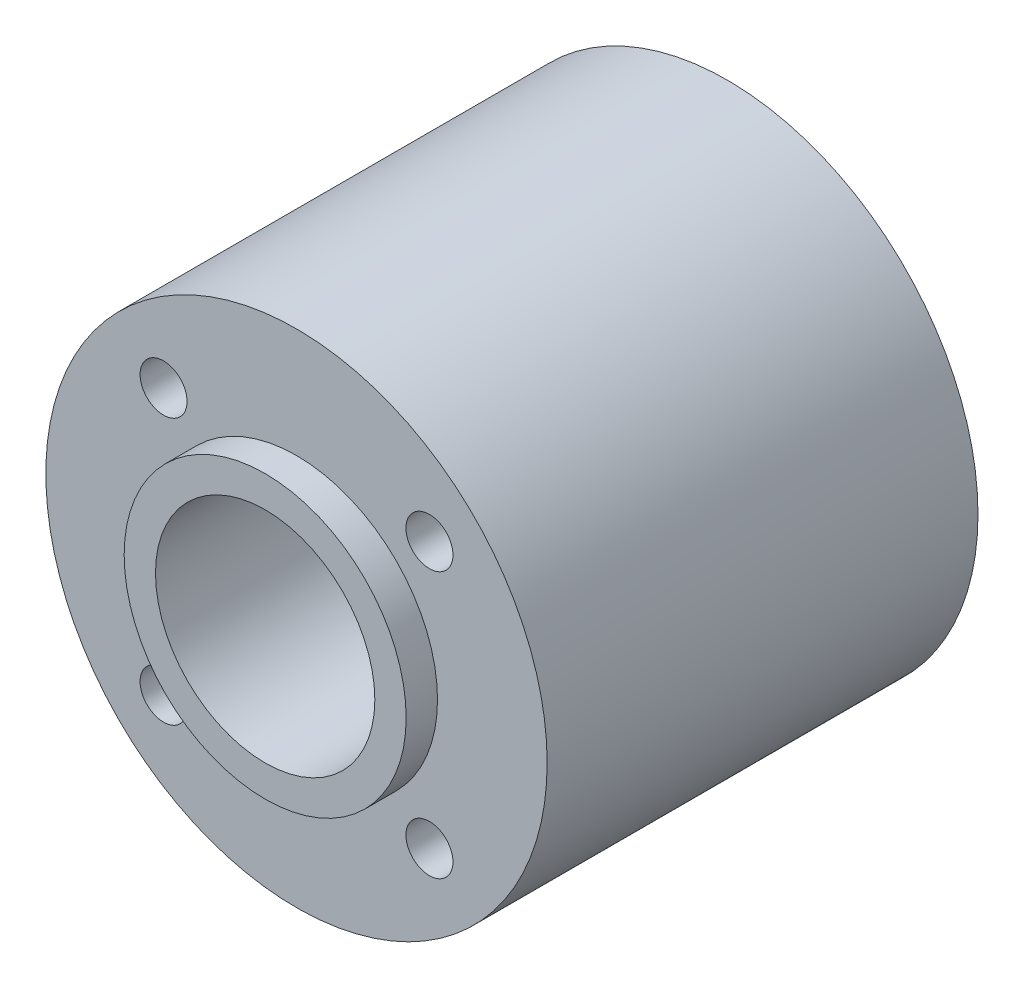
ISO-10303-21;
HEADER;
FILE_DESCRIPTION(('STEP AP214'),'2;1');
FILE_NAME('part.step','',(''),(''),'','','');
FILE_SCHEMA(('AUTOMOTIVE_DESIGN { 1 0 10303 214 1 1 1 1 }'));
ENDSEC;
DATA;
#1=APPLICATION_CONTEXT('core data for automotive mechanical design processes');
#2=APPLICATION_PROTOCOL_DEFINITION('international standard','automotive_design',2000,#1);
#3=PRODUCT_CONTEXT('',#1,'mechanical');
#4=PRODUCT('Part','Part','',(#3));
#5=PRODUCT_RELATED_PRODUCT_CATEGORY('part','',(#4));
#6=PRODUCT_DEFINITION_FORMATION('','',#4);
#7=PRODUCT_DEFINITION_CONTEXT('part definition',#1,'design');
#8=PRODUCT_DEFINITION('design','',#6,#7);
#9=PRODUCT_DEFINITION_SHAPE('','',#8);
#10=(LENGTH_UNIT() NAMED_UNIT(*) SI_UNIT(.MILLI.,.METRE.));
#11=(NAMED_UNIT(*) PLANE_ANGLE_UNIT() SI_UNIT($,.RADIAN.));
#12=(NAMED_UNIT(*) SI_UNIT($,.STERADIAN.) SOLID_ANGLE_UNIT());
#13=UNCERTAINTY_MEASURE_WITH_UNIT(LENGTH_MEASURE(1.E-05),#10,'distance_accuracy_value','');
#14=(GEOMETRIC_REPRESENTATION_CONTEXT(3) GLOBAL_UNCERTAINTY_ASSIGNED_CONTEXT((#13)) GLOBAL_UNIT_ASSIGNED_CONTEXT((#10,
#11,#12)) REPRESENTATION_CONTEXT('',''));
#15=CARTESIAN_POINT('',(0.,0.,0.));
#16=DIRECTION('',(0.,0.,1.));
#17=DIRECTION('',(1.,0.,0.));
#18=AXIS2_PLACEMENT_3D('',#15,#16,#17);
#19=CARTESIAN_POINT('',(0.,0.,27.5));
#20=DIRECTION('',(0.,0.,-1.));
#21=DIRECTION('',(-1.,0.,0.));
#22=AXIS2_PLACEMENT_3D('',#19,#20,#21);
#23=CYLINDRICAL_SURFACE('',#22,16.);
#24=CARTESIAN_POINT('',(0.,0.,27.5));
#25=DIRECTION('',(0.,0.,1.));
#26=DIRECTION('',(1.,0.,0.));
#27=AXIS2_PLACEMENT_3D('',#24,#25,#26);
#28=CIRCLE('',#27,16.);
#29=CARTESIAN_POINT('',(16.,0.,27.5));
#30=VERTEX_POINT('',#29);
#31=EDGE_CURVE('E10',#30,#30,#28,.T.);
#32=ORIENTED_EDGE('',*,*,#31,.F.);
#33=EDGE_LOOP('',(#32));
#34=FACE_BOUND('',#33,.T.);
#35=CARTESIAN_POINT('',(0.,0.,0.));
#36=DIRECTION('',(0.,0.,1.));
#37=DIRECTION('',(1.,0.,0.));
#38=AXIS2_PLACEMENT_3D('',#35,#36,#37);
#39=CIRCLE('',#38,16.);
#40=CARTESIAN_POINT('',(16.,0.,0.));
#41=VERTEX_POINT('',#40);
#42=EDGE_CURVE('E43',#41,#41,#39,.T.);
#43=ORIENTED_EDGE('',*,*,#42,.T.);
#44=EDGE_LOOP('',(#43));
#45=FACE_BOUND('',#44,.T.);
#46=ADVANCED_FACE('F39',(#34,#45),#23,.T.);
#47=CARTESIAN_POINT('',(-8.48528137423859,8.48528137423855,27.5));
#48=DIRECTION('',(0.,0.,-1.));
#49=DIRECTION('',(-1.,0.,0.));
#50=AXIS2_PLACEMENT_3D('',#47,#48,#49);
#51=CYLINDRICAL_SURFACE('',#50,1.5);
#52=CARTESIAN_POINT('',(-8.48528137423859,8.48528137423855,27.5));
#53=DIRECTION('',(0.,0.,1.));
#54=DIRECTION('',(1.,0.,0.));
#55=AXIS2_PLACEMENT_3D('',#52,#53,#54);
#56=CIRCLE('',#55,1.5);
#57=CARTESIAN_POINT('',(-6.98528137423859,8.48528137423855,27.5));
#58=VERTEX_POINT('',#57);
#59=EDGE_CURVE('E48',#58,#58,#56,.T.);
#60=ORIENTED_EDGE('',*,*,#59,.T.);
#61=EDGE_LOOP('',(#60));
#62=FACE_BOUND('',#61,.T.);
#63=CARTESIAN_POINT('',(-8.48528137423859,8.48528137423855,0.));
#64=DIRECTION('',(0.,0.,1.));
#65=DIRECTION('',(1.,0.,0.));
#66=AXIS2_PLACEMENT_3D('',#63,#64,#65);
#67=CIRCLE('',#66,1.5);
#68=CARTESIAN_POINT('',(-6.98528137423859,8.48528137423855,0.));
#69=VERTEX_POINT('',#68);
#70=EDGE_CURVE('E70',#69,#69,#67,.T.);
#71=ORIENTED_EDGE('',*,*,#70,.F.);
#72=EDGE_LOOP('',(#71));
#73=FACE_BOUND('',#72,.T.);
#74=ADVANCED_FACE('F107',(#62,#73),#51,.F.);
#75=CARTESIAN_POINT('',(8.48528137423856,8.48528137423927,27.5));
#76=DIRECTION('',(0.,0.,-1.));
#77=DIRECTION('',(-1.,0.,0.));
#78=AXIS2_PLACEMENT_3D('',#75,#76,#77);
#79=CYLINDRICAL_SURFACE('',#78,1.5);
#80=CARTESIAN_POINT('',(8.48528137423856,8.48528137423927,27.5));
#81=DIRECTION('',(0.,0.,1.));
#82=DIRECTION('',(1.,0.,0.));
#83=AXIS2_PLACEMENT_3D('',#80,#81,#82);
#84=CIRCLE('',#83,1.5);
#85=CARTESIAN_POINT('',(9.98528137423856,8.48528137423927,27.5));
#86=VERTEX_POINT('',#85);
#87=EDGE_CURVE('E54',#86,#86,#84,.T.);
#88=ORIENTED_EDGE('',*,*,#87,.T.);
#89=EDGE_LOOP('',(#88));
#90=FACE_BOUND('',#89,.T.);
#91=CARTESIAN_POINT('',(8.48528137423856,8.48528137423927,0.));
#92=DIRECTION('',(0.,0.,1.));
#93=DIRECTION('',(1.,0.,0.));
#94=AXIS2_PLACEMENT_3D('',#91,#92,#93);
#95=CIRCLE('',#94,1.5);
#96=CARTESIAN_POINT('',(9.98528137423856,8.48528137423927,0.));
#97=VERTEX_POINT('',#96);
#98=EDGE_CURVE('E67',#97,#97,#95,.T.);
#99=ORIENTED_EDGE('',*,*,#98,.F.);
#100=EDGE_LOOP('',(#99));
#101=FACE_BOUND('',#100,.T.);
#102=ADVANCED_FACE('F95',(#90,#101),#79,.F.);
#103=CARTESIAN_POINT('',(8.48528137423928,-8.48528137423787,27.5));
#104=DIRECTION('',(0.,0.,-1.));
#105=DIRECTION('',(-1.,0.,0.));
#106=AXIS2_PLACEMENT_3D('',#103,#104,#105);
#107=CYLINDRICAL_SURFACE('',#106,1.5);
#108=CARTESIAN_POINT('',(8.48528137423928,-8.48528137423787,27.5));
#109=DIRECTION('',(0.,0.,1.));
#110=DIRECTION('',(1.,0.,0.));
#111=AXIS2_PLACEMENT_3D('',#108,#109,#110);
#112=CIRCLE('',#111,1.5);
#113=CARTESIAN_POINT('',(9.98528137423928,-8.48528137423787,27.5));
#114=VERTEX_POINT('',#113);
#115=EDGE_CURVE('E82',#114,#114,#112,.T.);
#116=ORIENTED_EDGE('',*,*,#115,.T.);
#117=EDGE_LOOP('',(#116));
#118=FACE_BOUND('',#117,.T.);
#119=CARTESIAN_POINT('',(8.48528137423928,-8.48528137423787,0.));
#120=DIRECTION('',(0.,0.,1.));
#121=DIRECTION('',(1.,0.,0.));
#122=AXIS2_PLACEMENT_3D('',#119,#120,#121);
#123=CIRCLE('',#122,1.5);
#124=CARTESIAN_POINT('',(9.98528137423928,-8.48528137423787,0.));
#125=VERTEX_POINT('',#124);
#126=EDGE_CURVE('E62',#125,#125,#123,.T.);
#127=ORIENTED_EDGE('',*,*,#126,.F.);
#128=EDGE_LOOP('',(#127));
#129=FACE_BOUND('',#128,.T.);
#130=ADVANCED_FACE('F115',(#118,#129),#107,.F.);
#131=CARTESIAN_POINT('',(-8.48528137423786,-8.48528137423859,27.5));
#132=DIRECTION('',(0.,0.,-1.));
#133=DIRECTION('',(-1.,0.,0.));
#134=AXIS2_PLACEMENT_3D('',#131,#132,#133);
#135=CYLINDRICAL_SURFACE('',#134,1.5);
#136=CARTESIAN_POINT('',(-8.48528137423786,-8.48528137423859,27.5));
#137=DIRECTION('',(0.,0.,1.));
#138=DIRECTION('',(1.,0.,0.));
#139=AXIS2_PLACEMENT_3D('',#136,#137,#138);
#140=CIRCLE('',#139,1.5);
#141=CARTESIAN_POINT('',(-6.98528137423786,-8.48528137423859,27.5));
#142=VERTEX_POINT('',#141);
#143=EDGE_CURVE('E77',#142,#142,#140,.T.);
#144=ORIENTED_EDGE('',*,*,#143,.T.);
#145=EDGE_LOOP('',(#144));
#146=FACE_BOUND('',#145,.T.);
#147=CARTESIAN_POINT('',(-8.48528137423786,-8.48528137423859,0.));
#148=DIRECTION('',(0.,0.,1.));
#149=DIRECTION('',(1.,0.,0.));
#150=AXIS2_PLACEMENT_3D('',#147,#148,#149);
#151=CIRCLE('',#150,1.5);
#152=CARTESIAN_POINT('',(-6.98528137423786,-8.48528137423859,0.));
#153=VERTEX_POINT('',#152);
#154=EDGE_CURVE('E58',#153,#153,#151,.T.);
#155=ORIENTED_EDGE('',*,*,#154,.F.);
#156=EDGE_LOOP('',(#155));
#157=FACE_BOUND('',#156,.T.);
#158=ADVANCED_FACE('F41',(#146,#157),#135,.F.);
#159=CARTESIAN_POINT('',(0.,0.,27.5));
#160=DIRECTION('',(0.,0.,-1.));
#161=DIRECTION('',(-1.,0.,0.));
#162=AXIS2_PLACEMENT_3D('',#159,#160,#161);
#163=CYLINDRICAL_SURFACE('',#162,7.);
#164=CARTESIAN_POINT('',(0.,0.,29.5));
#165=DIRECTION('',(0.,0.,1.));
#166=DIRECTION('',(1.,0.,0.));
#167=AXIS2_PLACEMENT_3D('',#164,#165,#166);
#168=CIRCLE('',#167,7.);
#169=CARTESIAN_POINT('',(7.,0.,29.5));
#170=VERTEX_POINT('',#169);
#171=EDGE_CURVE('E151',#170,#170,#168,.T.);
#172=ORIENTED_EDGE('',*,*,#171,.T.);
#173=EDGE_LOOP('',(#172));
#174=FACE_BOUND('',#173,.T.);
#175=CARTESIAN_POINT('',(0.,0.,-2.));
#176=DIRECTION('',(0.,0.,1.));
#177=DIRECTION('',(1.,0.,0.));
#178=AXIS2_PLACEMENT_3D('',#175,#176,#177);
#179=CIRCLE('',#178,7.);
#180=CARTESIAN_POINT('',(7.,0.,-2.));
#181=VERTEX_POINT('',#180);
#182=EDGE_CURVE('E154',#181,#181,#179,.T.);
#183=ORIENTED_EDGE('',*,*,#182,.F.);
#184=EDGE_LOOP('',(#183));
#185=FACE_BOUND('',#184,.T.);
#186=ADVANCED_FACE('F102',(#174,#185),#163,.F.);
#187=CARTESIAN_POINT('',(0.,0.,27.5));
#188=DIRECTION('',(0.,0.,1.));
#189=DIRECTION('',(1.,0.,0.));
#190=AXIS2_PLACEMENT_3D('',#187,#188,#189);
#191=PLANE('',#190);
#192=CARTESIAN_POINT('',(0.,0.,27.5));
#193=DIRECTION('',(0.,0.,1.));
#194=DIRECTION('',(1.,0.,0.));
#195=AXIS2_PLACEMENT_3D('',#192,#193,#194);
#196=CIRCLE('',#195,9.);
#197=CARTESIAN_POINT('',(9.,0.,27.5));
#198=VERTEX_POINT('',#197);
#199=EDGE_CURVE('E63',#198,#198,#196,.F.);
#200=ORIENTED_EDGE('',*,*,#199,.T.);
#201=EDGE_LOOP('',(#200));
#202=FACE_BOUND('',#201,.T.);
#203=ORIENTED_EDGE('',*,*,#143,.F.);
#204=EDGE_LOOP('',(#203));
#205=FACE_BOUND('',#204,.T.);
#206=ORIENTED_EDGE('',*,*,#115,.F.);
#207=EDGE_LOOP('',(#206));
#208=FACE_BOUND('',#207,.T.);
#209=ORIENTED_EDGE('',*,*,#87,.F.);
#210=EDGE_LOOP('',(#209));
#211=FACE_BOUND('',#210,.T.);
#212=ORIENTED_EDGE('',*,*,#59,.F.);
#213=EDGE_LOOP('',(#212));
#214=FACE_BOUND('',#213,.T.);
#215=ORIENTED_EDGE('',*,*,#31,.T.);
#216=EDGE_LOOP('',(#215));
#217=FACE_BOUND('',#216,.T.);
#218=ADVANCED_FACE('F98',(#202,#205,#208,#211,#214,#217),#191,.T.);
#219=CARTESIAN_POINT('',(0.,0.,0.));
#220=DIRECTION('',(0.,0.,1.));
#221=DIRECTION('',(1.,0.,0.));
#222=AXIS2_PLACEMENT_3D('',#219,#220,#221);
#223=PLANE('',#222);
#224=CARTESIAN_POINT('',(0.,0.,0.));
#225=DIRECTION('',(0.,0.,1.));
#226=DIRECTION('',(1.,0.,0.));
#227=AXIS2_PLACEMENT_3D('',#224,#225,#226);
#228=CIRCLE('',#227,9.);
#229=CARTESIAN_POINT('',(9.,0.,0.));
#230=VERTEX_POINT('',#229);
#231=EDGE_CURVE('E158',#230,#230,#228,.T.);
#232=ORIENTED_EDGE('',*,*,#231,.T.);
#233=EDGE_LOOP('',(#232));
#234=FACE_BOUND('',#233,.T.);
#235=ORIENTED_EDGE('',*,*,#154,.T.);
#236=EDGE_LOOP('',(#235));
#237=FACE_BOUND('',#236,.T.);
#238=ORIENTED_EDGE('',*,*,#126,.T.);
#239=EDGE_LOOP('',(#238));
#240=FACE_BOUND('',#239,.T.);
#241=ORIENTED_EDGE('',*,*,#98,.T.);
#242=EDGE_LOOP('',(#241));
#243=FACE_BOUND('',#242,.T.);
#244=ORIENTED_EDGE('',*,*,#70,.T.);
#245=EDGE_LOOP('',(#244));
#246=FACE_BOUND('',#245,.T.);
#247=ORIENTED_EDGE('',*,*,#42,.F.);
#248=EDGE_LOOP('',(#247));
#249=FACE_BOUND('',#248,.T.);
#250=ADVANCED_FACE('F101',(#234,#237,#240,#243,#246,#249),#223,.F.);
#251=CARTESIAN_POINT('',(0.,0.,29.5));
#252=DIRECTION('',(0.,0.,-1.));
#253=DIRECTION('',(-1.,0.,0.));
#254=AXIS2_PLACEMENT_3D('',#251,#252,#253);
#255=CYLINDRICAL_SURFACE('',#254,9.);
#256=ORIENTED_EDGE('',*,*,#199,.F.);
#257=EDGE_LOOP('',(#256));
#258=FACE_BOUND('',#257,.T.);
#259=CARTESIAN_POINT('',(0.,0.,29.5));
#260=DIRECTION('',(0.,0.,1.));
#261=DIRECTION('',(1.,0.,0.));
#262=AXIS2_PLACEMENT_3D('',#259,#260,#261);
#263=CIRCLE('',#262,9.);
#264=CARTESIAN_POINT('',(9.,0.,29.5));
#265=VERTEX_POINT('',#264);
#266=EDGE_CURVE('E167',#265,#265,#263,.T.);
#267=ORIENTED_EDGE('',*,*,#266,.F.);
#268=EDGE_LOOP('',(#267));
#269=FACE_BOUND('',#268,.T.);
#270=ADVANCED_FACE('F131',(#258,#269),#255,.T.);
#271=CARTESIAN_POINT('',(0.,0.,29.5));
#272=DIRECTION('',(0.,0.,1.));
#273=DIRECTION('',(1.,0.,0.));
#274=AXIS2_PLACEMENT_3D('',#271,#272,#273);
#275=PLANE('',#274);
#276=ORIENTED_EDGE('',*,*,#171,.F.);
#277=EDGE_LOOP('',(#276));
#278=FACE_BOUND('',#277,.T.);
#279=ORIENTED_EDGE('',*,*,#266,.T.);
#280=EDGE_LOOP('',(#279));
#281=FACE_BOUND('',#280,.T.);
#282=ADVANCED_FACE('F139',(#278,#281),#275,.T.);
#283=CARTESIAN_POINT('',(0.,0.,-2.));
#284=DIRECTION('',(0.,0.,1.));
#285=DIRECTION('',(1.,0.,0.));
#286=AXIS2_PLACEMENT_3D('',#283,#284,#285);
#287=CYLINDRICAL_SURFACE('',#286,9.);
#288=CARTESIAN_POINT('',(0.,0.,-2.));
#289=DIRECTION('',(0.,0.,1.));
#290=DIRECTION('',(1.,0.,0.));
#291=AXIS2_PLACEMENT_3D('',#288,#289,#290);
#292=CIRCLE('',#291,9.);
#293=CARTESIAN_POINT('',(9.,0.,-2.));
#294=VERTEX_POINT('',#293);
#295=EDGE_CURVE('E157',#294,#294,#292,.T.);
#296=ORIENTED_EDGE('',*,*,#295,.T.);
#297=EDGE_LOOP('',(#296));
#298=FACE_BOUND('',#297,.T.);
#299=ORIENTED_EDGE('',*,*,#231,.F.);
#300=EDGE_LOOP('',(#299));
#301=FACE_BOUND('',#300,.T.);
#302=ADVANCED_FACE('F179',(#298,#301),#287,.T.);
#303=CARTESIAN_POINT('',(0.,0.,-2.));
#304=DIRECTION('',(0.,0.,1.));
#305=DIRECTION('',(1.,0.,0.));
#306=AXIS2_PLACEMENT_3D('',#303,#304,#305);
#307=PLANE('',#306);
#308=ORIENTED_EDGE('',*,*,#182,.T.);
#309=EDGE_LOOP('',(#308));
#310=FACE_BOUND('',#309,.T.);
#311=ORIENTED_EDGE('',*,*,#295,.F.);
#312=EDGE_LOOP('',(#311));
#313=FACE_BOUND('',#312,.T.);
#314=ADVANCED_FACE('F185',(#310,#313),#307,.F.);
#315=CLOSED_SHELL('',(#46,#74,#102,#130,#158,#186,#218,#250,#270,#282,#302,#314));
#316=MANIFOLD_SOLID_BREP('B2',#315);
#317=ADVANCED_BREP_SHAPE_REPRESENTATION('',(#18,#316),#14);
#318=SHAPE_DEFINITION_REPRESENTATION(#9,#317);
ENDSEC;
END-ISO-10303-21;
